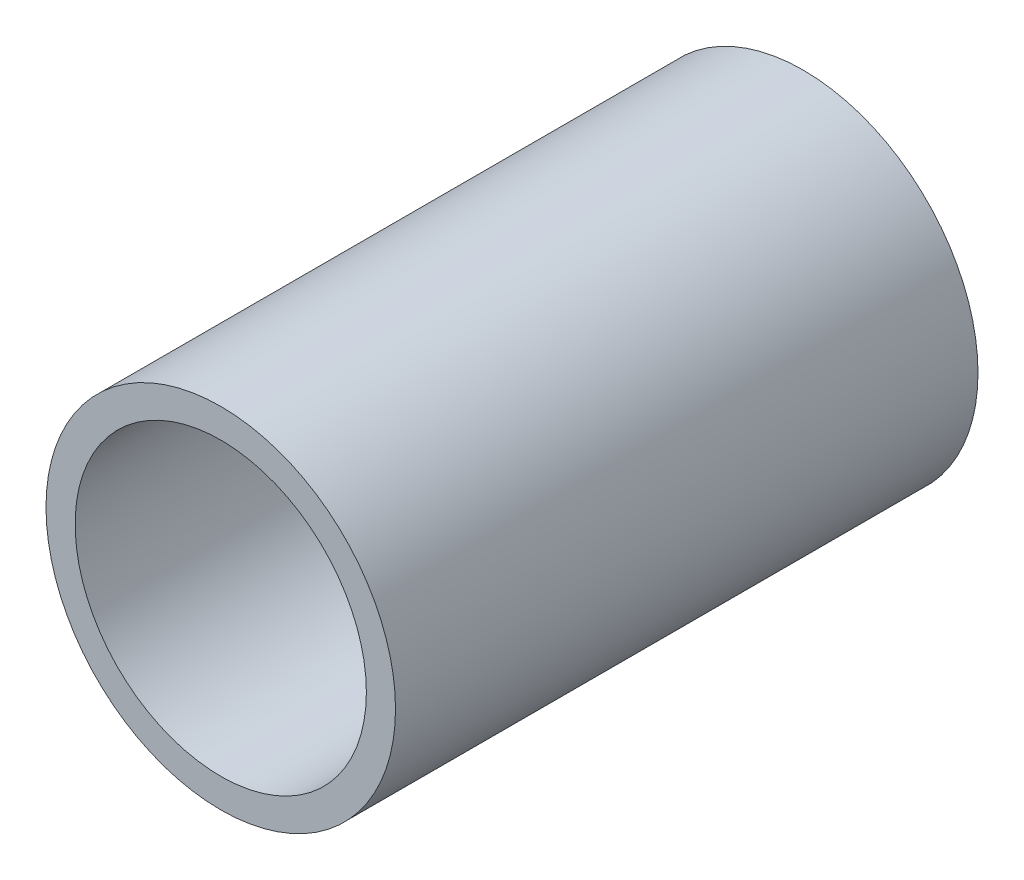
ISO-10303-21;
HEADER;
FILE_DESCRIPTION(('STEP AP214'),'2;1');
FILE_NAME('part.step','',(''),(''),'','','');
FILE_SCHEMA(('AUTOMOTIVE_DESIGN { 1 0 10303 214 1 1 1 1 }'));
ENDSEC;
DATA;
#1=APPLICATION_CONTEXT('core data for automotive mechanical design processes');
#2=APPLICATION_PROTOCOL_DEFINITION('international standard','automotive_design',2000,#1);
#3=PRODUCT_CONTEXT('',#1,'mechanical');
#4=PRODUCT('Part','Part','',(#3));
#5=PRODUCT_RELATED_PRODUCT_CATEGORY('part','',(#4));
#6=PRODUCT_DEFINITION_FORMATION('','',#4);
#7=PRODUCT_DEFINITION_CONTEXT('part definition',#1,'design');
#8=PRODUCT_DEFINITION('design','',#6,#7);
#9=PRODUCT_DEFINITION_SHAPE('','',#8);
#10=(LENGTH_UNIT() NAMED_UNIT(*) SI_UNIT(.MILLI.,.METRE.));
#11=(NAMED_UNIT(*) PLANE_ANGLE_UNIT() SI_UNIT($,.RADIAN.));
#12=(NAMED_UNIT(*) SI_UNIT($,.STERADIAN.) SOLID_ANGLE_UNIT());
#13=UNCERTAINTY_MEASURE_WITH_UNIT(LENGTH_MEASURE(1.E-05),#10,'distance_accuracy_value','');
#14=(GEOMETRIC_REPRESENTATION_CONTEXT(3) GLOBAL_UNCERTAINTY_ASSIGNED_CONTEXT((#13)) GLOBAL_UNIT_ASSIGNED_CONTEXT((#10,
#11,#12)) REPRESENTATION_CONTEXT('',''));
#15=CARTESIAN_POINT('',(0.,0.,0.));
#16=DIRECTION('',(0.,0.,1.));
#17=DIRECTION('',(1.,0.,0.));
#18=AXIS2_PLACEMENT_3D('',#15,#16,#17);
#19=CARTESIAN_POINT('',(0.,0.,100.));
#20=DIRECTION('',(0.,0.,1.));
#21=DIRECTION('',(1.,0.,0.));
#22=AXIS2_PLACEMENT_3D('',#19,#20,#21);
#23=PLANE('',#22);
#24=CARTESIAN_POINT('',(0.,0.,100.));
#25=DIRECTION('',(0.,0.,1.));
#26=DIRECTION('',(1.,0.,0.));
#27=AXIS2_PLACEMENT_3D('',#24,#25,#26);
#28=CIRCLE('',#27,30.);
#29=CARTESIAN_POINT('',(30.,0.,100.));
#30=VERTEX_POINT('',#29);
#31=EDGE_CURVE('E10',#30,#30,#28,.T.);
#32=ORIENTED_EDGE('',*,*,#31,.T.);
#33=EDGE_LOOP('',(#32));
#34=FACE_BOUND('',#33,.T.);
#35=CARTESIAN_POINT('',(0.,0.,100.));
#36=DIRECTION('',(0.,0.,1.));
#37=DIRECTION('',(1.,0.,0.));
#38=AXIS2_PLACEMENT_3D('',#35,#36,#37);
#39=CIRCLE('',#38,25.);
#40=CARTESIAN_POINT('',(25.,0.,100.));
#41=VERTEX_POINT('',#40);
#42=EDGE_CURVE('E42',#41,#41,#39,.T.);
#43=ORIENTED_EDGE('',*,*,#42,.F.);
#44=EDGE_LOOP('',(#43));
#45=FACE_BOUND('',#44,.T.);
#46=ADVANCED_FACE('F31',(#34,#45),#23,.T.);
#47=CARTESIAN_POINT('',(0.,0.,0.));
#48=DIRECTION('',(0.,0.,1.));
#49=DIRECTION('',(1.,0.,0.));
#50=AXIS2_PLACEMENT_3D('',#47,#48,#49);
#51=PLANE('',#50);
#52=CARTESIAN_POINT('',(0.,0.,0.));
#53=DIRECTION('',(0.,0.,1.));
#54=DIRECTION('',(1.,0.,0.));
#55=AXIS2_PLACEMENT_3D('',#52,#53,#54);
#56=CIRCLE('',#55,30.);
#57=CARTESIAN_POINT('',(30.,0.,0.));
#58=VERTEX_POINT('',#57);
#59=EDGE_CURVE('E35',#58,#58,#56,.T.);
#60=ORIENTED_EDGE('',*,*,#59,.F.);
#61=EDGE_LOOP('',(#60));
#62=FACE_BOUND('',#61,.T.);
#63=CARTESIAN_POINT('',(0.,0.,0.));
#64=DIRECTION('',(0.,0.,1.));
#65=DIRECTION('',(1.,0.,0.));
#66=AXIS2_PLACEMENT_3D('',#63,#64,#65);
#67=CIRCLE('',#66,25.);
#68=CARTESIAN_POINT('',(25.,0.,0.));
#69=VERTEX_POINT('',#68);
#70=EDGE_CURVE('E44',#69,#69,#67,.T.);
#71=ORIENTED_EDGE('',*,*,#70,.T.);
#72=EDGE_LOOP('',(#71));
#73=FACE_BOUND('',#72,.T.);
#74=ADVANCED_FACE('F54',(#62,#73),#51,.F.);
#75=CARTESIAN_POINT('',(0.,0.,100.));
#76=DIRECTION('',(0.,0.,-1.));
#77=DIRECTION('',(-1.,0.,0.));
#78=AXIS2_PLACEMENT_3D('',#75,#76,#77);
#79=CYLINDRICAL_SURFACE('',#78,30.);
#80=ORIENTED_EDGE('',*,*,#31,.F.);
#81=EDGE_LOOP('',(#80));
#82=FACE_BOUND('',#81,.T.);
#83=ORIENTED_EDGE('',*,*,#59,.T.);
#84=EDGE_LOOP('',(#83));
#85=FACE_BOUND('',#84,.T.);
#86=ADVANCED_FACE('F33',(#82,#85),#79,.T.);
#87=CARTESIAN_POINT('',(0.,0.,100.));
#88=DIRECTION('',(0.,0.,-1.));
#89=DIRECTION('',(-1.,0.,0.));
#90=AXIS2_PLACEMENT_3D('',#87,#88,#89);
#91=CYLINDRICAL_SURFACE('',#90,25.);
#92=ORIENTED_EDGE('',*,*,#42,.T.);
#93=EDGE_LOOP('',(#92));
#94=FACE_BOUND('',#93,.T.);
#95=ORIENTED_EDGE('',*,*,#70,.F.);
#96=EDGE_LOOP('',(#95));
#97=FACE_BOUND('',#96,.T.);
#98=ADVANCED_FACE('F50',(#94,#97),#91,.F.);
#99=CLOSED_SHELL('',(#46,#74,#86,#98));
#100=MANIFOLD_SOLID_BREP('B2',#99);
#101=ADVANCED_BREP_SHAPE_REPRESENTATION('',(#18,#100),#14);
#102=SHAPE_DEFINITION_REPRESENTATION(#9,#101);
ENDSEC;
END-ISO-10303-21;
